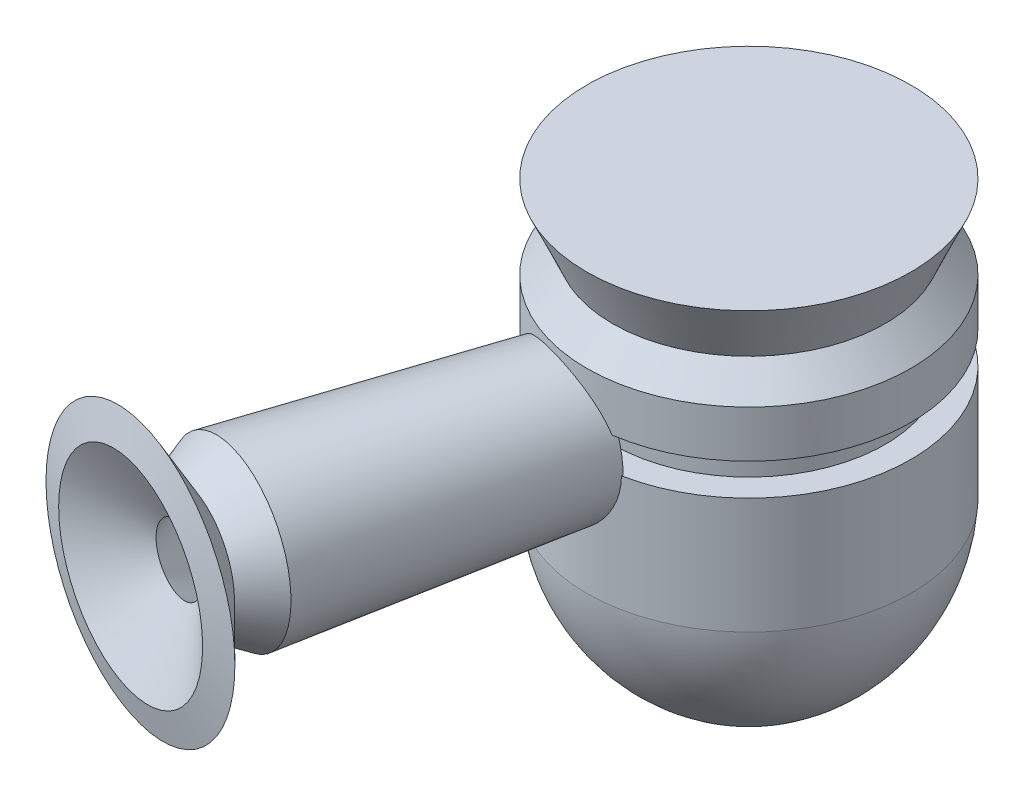
ISO-10303-21;
HEADER;
FILE_DESCRIPTION(('STEP AP214'),'2;1');
FILE_NAME('part.step','',(''),(''),'','','');
FILE_SCHEMA(('AUTOMOTIVE_DESIGN { 1 0 10303 214 1 1 1 1 }'));
ENDSEC;
DATA;
#1=APPLICATION_CONTEXT('core data for automotive mechanical design processes');
#2=APPLICATION_PROTOCOL_DEFINITION('international standard','automotive_design',2000,#1);
#3=PRODUCT_CONTEXT('',#1,'mechanical');
#4=PRODUCT('Part','Part','',(#3));
#5=PRODUCT_RELATED_PRODUCT_CATEGORY('part','',(#4));
#6=PRODUCT_DEFINITION_FORMATION('','',#4);
#7=PRODUCT_DEFINITION_CONTEXT('part definition',#1,'design');
#8=PRODUCT_DEFINITION('design','',#6,#7);
#9=PRODUCT_DEFINITION_SHAPE('','',#8);
#10=(LENGTH_UNIT() NAMED_UNIT(*) SI_UNIT(.MILLI.,.METRE.));
#11=(NAMED_UNIT(*) PLANE_ANGLE_UNIT() SI_UNIT($,.RADIAN.));
#12=(NAMED_UNIT(*) SI_UNIT($,.STERADIAN.) SOLID_ANGLE_UNIT());
#13=UNCERTAINTY_MEASURE_WITH_UNIT(LENGTH_MEASURE(1.E-05),#10,'distance_accuracy_value','');
#14=(GEOMETRIC_REPRESENTATION_CONTEXT(3) GLOBAL_UNCERTAINTY_ASSIGNED_CONTEXT((#13)) GLOBAL_UNIT_ASSIGNED_CONTEXT((#10,
#11,#12)) REPRESENTATION_CONTEXT('',''));
#15=CARTESIAN_POINT('',(0.,0.,0.));
#16=DIRECTION('',(0.,0.,1.));
#17=DIRECTION('',(1.,0.,0.));
#18=AXIS2_PLACEMENT_3D('',#15,#16,#17);
#19=CARTESIAN_POINT('',(-7.10834936745736,69.4079551613164,0.));
#20=DIRECTION('',(0.,1.,0.));
#21=DIRECTION('',(0.,0.,1.));
#22=AXIS2_PLACEMENT_3D('',#19,#20,#21);
#23=DEGENERATE_TOROIDAL_SURFACE('',#22,2.90756293698891,28.732983162707,.F.);
#24=CARTESIAN_POINT('',(-7.10834936745736,67.5094606230751,0.));
#25=DIRECTION('',(0.,1.,0.));
#26=DIRECTION('',(0.,0.,1.));
#27=AXIS2_PLACEMENT_3D('',#24,#25,#26);
#28=CIRCLE('',#27,25.7626313406345);
#29=CARTESIAN_POINT('',(-7.10834936745736,67.5094606230751,25.7626313406345));
#30=VERTEX_POINT('',#29);
#31=EDGE_CURVE('E114',#30,#30,#28,.T.);
#32=ORIENTED_EDGE('',*,*,#31,.F.);
#33=EDGE_LOOP('',(#32));
#34=FACE_BOUND('',#33,.T.);
#35=CARTESIAN_POINT('',(-7.10834936745736,44.8656856179775,0.));
#36=DIRECTION('',(0.,1.,0.));
#37=DIRECTION('',(0.,0.,1.));
#38=AXIS2_PLACEMENT_3D('',#35,#36,#37);
#39=CIRCLE('',#38,12.0343689023184);
#40=CARTESIAN_POINT('',(-7.10834936745736,44.8656856179775,12.0343689023184));
#41=VERTEX_POINT('',#40);
#42=EDGE_CURVE('E181',#41,#41,#39,.T.);
#43=ORIENTED_EDGE('',*,*,#42,.T.);
#44=EDGE_LOOP('',(#43));
#45=FACE_BOUND('',#44,.T.);
#46=ADVANCED_FACE('F39',(#34,#45),#23,.F.);
#47=CARTESIAN_POINT('',(-7.10834936745736,111.750471125418,0.));
#48=DIRECTION('',(0.,1.,0.));
#49=DIRECTION('',(0.,0.,1.));
#50=AXIS2_PLACEMENT_3D('',#47,#48,#49);
#51=CYLINDRICAL_SURFACE('',#50,25.7626313406345);
#52=CARTESIAN_POINT('',(-7.10834936745736,85.9516518030481,0.));
#53=DIRECTION('',(0.,1.,0.));
#54=DIRECTION('',(0.,0.,1.));
#55=AXIS2_PLACEMENT_3D('',#52,#53,#54);
#56=CIRCLE('',#55,25.7626313406345);
#57=CARTESIAN_POINT('',(-2.09294077422868,85.9516518030481,25.269722005523));
#58=VERTEX_POINT('',#57);
#59=CARTESIAN_POINT('',(-23.9964342906463,85.9516518030481,19.4552245224927));
#60=VERTEX_POINT('',#59);
#61=EDGE_CURVE('E108',#58,#60,#56,.T.);
#62=ORIENTED_EDGE('',*,*,#61,.F.);
#63=CARTESIAN_POINT('',(-2.09294077610805,85.9518518030481,25.269722005896));
#64=CARTESIAN_POINT('',(-2.09293656720588,85.7984719645325,25.2697190061388));
#65=CARTESIAN_POINT('',(-2.09625171683151,85.6451124607333,25.2703794127459));
#66=CARTESIAN_POINT('',(-2.10949883966492,85.3386968253718,25.2730040409252));
#67=CARTESIAN_POINT('',(-2.11943054359196,85.1856406817176,25.2749682094368));
#68=CARTESIAN_POINT('',(-2.1591011271364,84.7274980731125,25.2827786131677));
#69=CARTESIAN_POINT('',(-2.19871553421019,84.4232405162723,25.2905428025748));
#70=CARTESIAN_POINT('',(-2.30352003284658,83.8206857620337,25.3106617286325));
#71=CARTESIAN_POINT('',(-2.36860248504489,83.5223689610565,25.3229971337969));
#72=CARTESIAN_POINT('',(-2.52351461497049,82.9324038389565,25.3515020923657));
#73=CARTESIAN_POINT('',(-2.61334603920579,82.640755990028,25.3676719163495));
#74=CARTESIAN_POINT('',(-2.81655424163558,82.0664575600913,25.4028398730641));
#75=CARTESIAN_POINT('',(-2.92989541344612,81.7837941099825,25.4218337165326));
#76=CARTESIAN_POINT('',(-3.17901546214921,81.2286087754976,25.4615277132247));
#77=CARTESIAN_POINT('',(-3.31480285190694,80.9560907870784,25.482228512323));
#78=CARTESIAN_POINT('',(-3.7541219181697,80.1557403358051,25.5450591712052));
#79=CARTESIAN_POINT('',(-4.08959645001822,79.6451505658393,25.5879145916644));
#80=CARTESIAN_POINT('',(-4.85730388275295,78.6520977178606,25.6671567731319));
#81=CARTESIAN_POINT('',(-5.29411207676983,78.1731249279475,25.7030057414124));
#82=CARTESIAN_POINT('',(-6.00212431319835,77.5108349415528,25.7399610587167));
#83=CARTESIAN_POINT('',(-6.24709673261927,77.2993194227518,25.7494771489108));
#84=CARTESIAN_POINT('',(-6.75308821415843,76.8962921263743,25.7614225584039));
#85=CARTESIAN_POINT('',(-7.01410097680999,76.7047725746039,25.7638546418471));
#86=CARTESIAN_POINT('',(-7.56001705571709,76.3366135046553,25.7601692475637));
#87=CARTESIAN_POINT('',(-7.84544028875725,76.1607475720544,25.7537439769097));
#88=CARTESIAN_POINT('',(-8.42956332089683,75.8333818654893,25.7303902336893));
#89=CARTESIAN_POINT('',(-8.72826357925785,75.6818829352352,25.7134613975343));
#90=CARTESIAN_POINT('',(-9.33644751440155,75.4048061691808,25.6679116406755));
#91=CARTESIAN_POINT('',(-9.64592609701972,75.2792162771985,25.6392961766331));
#92=CARTESIAN_POINT('',(-10.2731973240358,75.0552548112737,25.5694437715472));
#93=CARTESIAN_POINT('',(-10.5909892426523,74.9568808699121,25.5282079289634));
#94=CARTESIAN_POINT('',(-11.2108675136647,74.7940967511485,25.4356864277996));
#95=CARTESIAN_POINT('',(-11.5126039951747,74.7278717765181,25.3852449408476));
#96=CARTESIAN_POINT('',(-12.1184104505612,74.6209354670245,25.2726602080328));
#97=CARTESIAN_POINT('',(-12.4224803248225,74.5802230490676,25.2105174590737));
#98=CARTESIAN_POINT('',(-13.0303013593332,74.5247964031969,25.0747003924042));
#99=CARTESIAN_POINT('',(-13.3340525946605,74.5100728861688,25.0010302051562));
#100=CARTESIAN_POINT('',(-13.9387930760471,74.5067574313359,24.8426225659441));
#101=CARTESIAN_POINT('',(-14.2397824336818,74.5181644331917,24.7578855631873));
#102=CARTESIAN_POINT('',(-14.8163737625817,74.5652875163419,24.584222561219));
#103=CARTESIAN_POINT('',(-15.0923177543474,74.5993103458273,24.4959656536494));
#104=CARTESIAN_POINT('',(-15.6377953389911,74.6895390848929,24.3114092050908));
#105=CARTESIAN_POINT('',(-15.9073292827304,74.7457437773464,24.2151101056082));
#106=CARTESIAN_POINT('',(-16.4383149656407,74.8797496110761,24.015523613745));
#107=CARTESIAN_POINT('',(-16.6997664913399,74.9575513222293,23.9122360370151));
#108=CARTESIAN_POINT('',(-17.21310815528,75.1339988605417,23.6998774303569));
#109=CARTESIAN_POINT('',(-17.464997962147,75.2326454093298,23.590806200302));
#110=CARTESIAN_POINT('',(-17.9629588816335,75.4521221295751,23.3659319131324));
#111=CARTESIAN_POINT('',(-18.2088074717179,75.5733626585506,23.2500370609032));
#112=CARTESIAN_POINT('',(-18.6881871041073,75.83568165621,23.0150348072124));
#113=CARTESIAN_POINT('',(-18.9217136965166,75.9767672250987,22.8959262683314));
#114=CARTESIAN_POINT('',(-19.3754639248792,76.2777263658809,22.6560575638176));
#115=CARTESIAN_POINT('',(-19.5956860046567,76.4376021291718,22.5352972069966));
#116=CARTESIAN_POINT('',(-20.0220543633753,76.7750963211925,22.2937087861105));
#117=CARTESIAN_POINT('',(-20.2281996893647,76.9527159491254,22.1728807180189));
#118=CARTESIAN_POINT('',(-20.6423395754946,77.3401664899157,21.9227636529709));
#119=CARTESIAN_POINT('',(-20.8490591087671,77.5514480104335,21.7936077880012));
#120=CARTESIAN_POINT('',(-21.2445536526636,77.992354194377,21.5391783990673));
#121=CARTESIAN_POINT('',(-21.4333278238243,78.2219797149899,21.4139050569076));
#122=CARTESIAN_POINT('',(-21.7924113710254,78.6984320640819,21.1692872375535));
#123=CARTESIAN_POINT('',(-21.9627107781069,78.9452680624721,21.0499459799361));
#124=CARTESIAN_POINT('',(-22.2841553645455,79.4547610075272,20.8193953074831));
#125=CARTESIAN_POINT('',(-22.4352980853653,79.7174199785173,20.7081869371819));
#126=CARTESIAN_POINT('',(-22.7244961829812,80.269932951842,20.491055824861));
#127=CARTESIAN_POINT('',(-22.8615945417053,80.5604856208535,20.3856318041267));
#128=CARTESIAN_POINT('',(-23.1133389118103,81.1555167794725,20.1885868813626));
#129=CARTESIAN_POINT('',(-23.2279944112062,81.4599893168238,20.0969601501428));
#130=CARTESIAN_POINT('',(-23.4340714859646,82.0805521388644,19.9299163710126));
#131=CARTESIAN_POINT('',(-23.5255244873988,82.396626038544,19.8544774195529));
#132=CARTESIAN_POINT('',(-23.6846780808781,83.0382663013493,19.7217957654183));
#133=CARTESIAN_POINT('',(-23.7523889469609,83.3638284923414,19.6645451930172));
#134=CARTESIAN_POINT('',(-23.8705181594839,84.0634464229282,19.5639909510259));
#135=CARTESIAN_POINT('',(-23.9176920276149,84.4384528419784,19.5233457736116));
#136=CARTESIAN_POINT('',(-23.9649115695213,85.0041926646897,19.482552543093));
#137=CARTESIAN_POINT('',(-23.9767278786373,85.1933360762144,19.4723172033995));
#138=CARTESIAN_POINT('',(-23.9924917370845,85.5722560863729,19.4586477029738));
#139=CARTESIAN_POINT('',(-23.996436767373,85.7620328682472,19.4552157195195));
#140=CARTESIAN_POINT('',(-23.9964342891857,85.9518518030481,19.4552245237605));
#141=B_SPLINE_CURVE_WITH_KNOTS('',3,(#63,#64,#65,#66,#67,#68,#69,#70,#71,#72,#73,#74,#75,#76,
#77,#78,#79,#80,#81,#82,#83,#84,#85,#86,#87,#88,#89,#90,#91,#92,#93,#94,#95,#96,#97,#98,#99,
#100,#101,#102,#103,#104,#105,#106,#107,#108,#109,#110,#111,#112,#113,#114,#115,#116,#117,#118,
#119,#120,#121,#122,#123,#124,#125,#126,#127,#128,#129,#130,#131,#132,#133,#134,#135,#136,#137,
#138,#139,#140),.UNSPECIFIED.,.F.,.F.,(4,2,2,2,2,2,2,2,2,2,2,2,2,2,2,2,2,2,2,2,2,2,2,2,2,2,2,2,
2,2,2,2,2,2,2,2,2,2,4),(0.,0.460061772684806,0.920104822904582,1.83960224754661,
2.75525472329127,3.67097183219267,4.58531204971273,5.49999983529855,7.32949908354318,
9.26804143543077,10.2385171656345,11.208614170298,12.2132851332336,13.2179908755268,
14.2222280410282,15.2263778240116,16.1641720455435,17.1019264518625,18.0393456122569,
18.9767267341852,19.8508195522371,20.7248644151719,21.5989323435782,22.4730305363614,
23.3649056855801,24.257100747496,25.1493999646751,26.0417595279431,27.0084155137945,
27.9751166964657,28.9423369421209,29.9096811937884,30.9227750566062,31.9354396911706,
32.9467253345908,33.9575728183246,35.0955116294597,35.6646308529003,36.2339321821698),.UNSPECIFIED.);
#142=EDGE_CURVE('E93',#58,#60,#141,.T.);
#143=ORIENTED_EDGE('',*,*,#142,.T.);
#144=EDGE_LOOP('',(#62,#143));
#145=FACE_BOUND('',#144,.T.);
#146=ORIENTED_EDGE('',*,*,#31,.T.);
#147=EDGE_LOOP('',(#146));
#148=FACE_BOUND('',#147,.T.);
#149=ADVANCED_FACE('F106',(#145,#148),#51,.T.);
#150=CARTESIAN_POINT('',(18.6542819731771,85.9516518030481,0.));
#151=DIRECTION('',(0.,-1.,0.));
#152=DIRECTION('',(0.,0.,-1.));
#153=AXIS2_PLACEMENT_3D('',#150,#151,#152);
#154=PLANE('',#153);
#155=CARTESIAN_POINT('',(-7.10834936745736,85.9516518030481,0.));
#156=DIRECTION('',(0.,1.,0.));
#157=DIRECTION('',(0.,0.,1.));
#158=AXIS2_PLACEMENT_3D('',#155,#156,#157);
#159=CIRCLE('',#158,21.6625311354834);
#160=CARTESIAN_POINT('',(-7.10834936745736,85.9516518030481,21.6625311354834));
#161=VERTEX_POINT('',#160);
#162=EDGE_CURVE('E115',#161,#161,#159,.T.);
#163=ORIENTED_EDGE('',*,*,#162,.F.);
#164=EDGE_LOOP('',(#163));
#165=FACE_BOUND('',#164,.T.);
#166=DIRECTION('',(0.961481196986305,0.,0.274870711138495));
#167=VECTOR('',#166,1.);
#168=CARTESIAN_POINT('',(-12.9415633990391,85.9516518030481,21.9389380676489));
#169=LINE('',#168,#167);
#170=CARTESIAN_POINT('',(-12.9415633990391,85.9516518030481,21.9389380676489));
#171=VERTEX_POINT('',#170);
#172=CARTESIAN_POINT('',(-2.04755275040952,85.9516518030481,25.0533457789229));
#173=VERTEX_POINT('',#172);
#174=EDGE_CURVE('E60',#171,#173,#169,.T.);
#175=ORIENTED_EDGE('',*,*,#174,.T.);
#176=DIRECTION('',(-0.20529636257545,0.,0.978699853639148));
#177=VECTOR('',#176,1.);
#178=CARTESIAN_POINT('',(52.0900141332175,85.9516518030481,-233.034172775687));
#179=LINE('',#178,#177);
#180=EDGE_CURVE('E110',#173,#58,#179,.T.);
#181=ORIENTED_EDGE('',*,*,#180,.T.);
#182=ORIENTED_EDGE('',*,*,#61,.T.);
#183=DIRECTION('',(0.975678364948973,0.,0.219207044071349));
#184=VECTOR('',#183,1.);
#185=CARTESIAN_POINT('',(-12.9415633990391,85.9516518030481,21.9389380676489));
#186=LINE('',#185,#184);
#187=EDGE_CURVE('E86',#60,#171,#186,.T.);
#188=ORIENTED_EDGE('',*,*,#187,.T.);
#189=EDGE_LOOP('',(#175,#181,#182,#188));
#190=FACE_BOUND('',#189,.T.);
#191=ADVANCED_FACE('F112',(#165,#190),#154,.F.);
#192=CARTESIAN_POINT('',(-7.10834936745736,111.750471125418,0.));
#193=DIRECTION('',(0.,1.,0.));
#194=DIRECTION('',(0.,0.,1.));
#195=AXIS2_PLACEMENT_3D('',#192,#193,#194);
#196=CYLINDRICAL_SURFACE('',#195,21.6625311354834);
#197=CARTESIAN_POINT('',(-7.10834936745736,91.0387429370366,0.));
#198=DIRECTION('',(0.,1.,0.));
#199=DIRECTION('',(0.,0.,1.));
#200=AXIS2_PLACEMENT_3D('',#197,#198,#199);
#201=CIRCLE('',#200,21.6625311354834);
#202=CARTESIAN_POINT('',(-7.10834936745736,91.0387429370366,21.6625311354834));
#203=VERTEX_POINT('',#202);
#204=EDGE_CURVE('E122',#203,#203,#201,.T.);
#205=ORIENTED_EDGE('',*,*,#204,.F.);
#206=EDGE_LOOP('',(#205));
#207=FACE_BOUND('',#206,.T.);
#208=ORIENTED_EDGE('',*,*,#162,.T.);
#209=EDGE_LOOP('',(#208));
#210=FACE_BOUND('',#209,.T.);
#211=ADVANCED_FACE('F163',(#207,#210),#196,.T.);
#212=CARTESIAN_POINT('',(14.554181768026,91.0387429370366,0.));
#213=DIRECTION('',(0.,1.,0.));
#214=DIRECTION('',(0.,0.,1.));
#215=AXIS2_PLACEMENT_3D('',#212,#213,#214);
#216=PLANE('',#215);
#217=CARTESIAN_POINT('',(-7.10834936745736,91.0387429370366,0.));
#218=DIRECTION('',(0.,1.,0.));
#219=DIRECTION('',(0.,0.,1.));
#220=AXIS2_PLACEMENT_3D('',#217,#218,#219);
#221=CIRCLE('',#220,25.7626313406345);
#222=CARTESIAN_POINT('',(-3.36701650641079,91.0387429370366,25.4895194544012));
#223=VERTEX_POINT('',#222);
#224=CARTESIAN_POINT('',(-22.9902396388921,91.0387429370366,20.2849386244955));
#225=VERTEX_POINT('',#224);
#226=EDGE_CURVE('E213',#223,#225,#221,.T.);
#227=ORIENTED_EDGE('',*,*,#226,.F.);
#228=CARTESIAN_POINT('',(-9.8769554664626,91.0387429370366,57.2249846654147));
#229=CARTESIAN_POINT('',(-9.05595094930689,91.0387429370366,53.2338685762515));
#230=CARTESIAN_POINT('',(-8.23565477818761,91.0387429370366,49.24260664151));
#231=CARTESIAN_POINT('',(-6.59676100523314,91.0387429370366,41.2597360248926));
#232=CARTESIAN_POINT('',(-5.77816340260163,91.0387429370366,37.2681273431801));
#233=CARTESIAN_POINT('',(-4.18782666368438,91.0387429370366,29.5036164298889));
#234=CARTESIAN_POINT('',(-3.41598184459158,91.0387429370366,25.7307358479373));
#235=CARTESIAN_POINT('',(-1.87437693254286,91.0387429370366,18.1845489166023));
#236=CARTESIAN_POINT('',(-1.1046168394996,91.0387429370366,14.4112425672367));
#237=CARTESIAN_POINT('',(0.432436478652625,91.0387429370366,6.86412386045209));
#238=CARTESIAN_POINT('',(1.1997297016049,91.0387429370366,3.09031150259364));
#239=CARTESIAN_POINT('',(2.73130938881674,91.0387429370366,-4.45792394190587));
#240=CARTESIAN_POINT('',(3.49559585252922,91.0387429370366,-8.23234702865792));
#241=CARTESIAN_POINT('',(4.25810918950469,91.0387429370366,-12.0071288022875));
#242=B_SPLINE_CURVE_WITH_KNOTS('',3,(#228,#229,#230,#231,#232,#233,#234,#235,#236,#237,#238,
#239,#240,#241),.UNSPECIFIED.,.F.,.F.,(4,2,2,2,2,2,4),(0.,12.2240544705132,24.4481032088688,
36.0011694243512,47.5542351558266,59.1073109849516,70.660388916059),.UNSPECIFIED.);
#243=CARTESIAN_POINT('',(-3.21686852129637,91.0387429370366,24.7551086473187));
#244=VERTEX_POINT('',#243);
#245=EDGE_CURVE('E68',#223,#244,#242,.T.);
#246=ORIENTED_EDGE('',*,*,#245,.T.);
#247=CARTESIAN_POINT('',(20.6041894149497,91.0387429370366,31.5401082758572));
#248=CARTESIAN_POINT('',(19.2060251717694,91.0387429370366,31.1408585583847));
#249=CARTESIAN_POINT('',(17.8078493728327,91.0387429370366,30.7416492929272));
#250=CARTESIAN_POINT('',(15.0114303592336,91.0387429370366,29.9433801804545));
#251=CARTESIAN_POINT('',(13.6131871438421,91.0387429370366,29.5443203359935));
#252=CARTESIAN_POINT('',(10.8160515812716,91.0387429370366,28.7462652664865));
#253=CARTESIAN_POINT('',(9.4171592065898,91.0387429370366,28.3472701378143));
#254=CARTESIAN_POINT('',(6.61928478532365,91.0387429370366,27.5496809707084));
#255=CARTESIAN_POINT('',(5.22030274057281,91.0387429370366,27.1510869258425));
#256=CARTESIAN_POINT('',(2.42312655826814,91.0387429370366,26.354887048256));
#257=CARTESIAN_POINT('',(1.02493256301489,91.0387429370366,25.957280716081));
#258=CARTESIAN_POINT('',(-1.07272730861461,91.0387429370366,25.3620373412416));
#259=CARTESIAN_POINT('',(-1.77202628762334,91.0387429370366,25.1638122802989));
#260=CARTESIAN_POINT('',(-3.17080331376586,91.0387429370366,24.7680001743798));
#261=CARTESIAN_POINT('',(-3.87028136050842,91.0387429370366,24.5704131280222));
#262=CARTESIAN_POINT('',(-5.26933303864536,91.0387429370366,24.1763679604304));
#263=CARTESIAN_POINT('',(-5.96890658118563,91.0387429370366,23.9799095237877));
#264=CARTESIAN_POINT('',(-7.36859747004313,91.0387429370366,23.5889035784879));
#265=CARTESIAN_POINT('',(-8.06871482202207,91.0387429370366,23.3943560900219));
#266=CARTESIAN_POINT('',(-9.11961661660344,91.0387429370366,23.1053178855964));
#267=CARTESIAN_POINT('',(-9.47001930243945,91.0387429370366,23.0094407394565));
#268=CARTESIAN_POINT('',(-10.1711740606715,91.0387429370366,22.8189707990595));
#269=CARTESIAN_POINT('',(-10.5219261330514,91.0387429370366,22.7243780047434));
#270=CARTESIAN_POINT('',(-11.2238712668706,91.0387429370366,22.5368763151678));
#271=CARTESIAN_POINT('',(-11.5750643169521,91.0387429370366,22.4439673774537));
#272=CARTESIAN_POINT('',(-12.2779840435742,91.0387429370366,22.2601911339159));
#273=CARTESIAN_POINT('',(-12.6297107190685,91.0387429370366,22.1693238240946));
#274=CARTESIAN_POINT('',(-13.3301282432284,91.0387429370366,21.9906977965624));
#275=CARTESIAN_POINT('',(-13.6788134128345,91.0387429370366,21.9029168096609));
#276=CARTESIAN_POINT('',(-14.37668287592,91.0387429370366,21.7293612320115));
#277=CARTESIAN_POINT('',(-14.7258671703341,91.0387429370366,21.6435866450257));
#278=CARTESIAN_POINT('',(-15.4246478946681,91.0387429370366,21.4736975006739));
#279=CARTESIAN_POINT('',(-15.7742443346198,91.0387429370366,21.3895829846365));
#280=CARTESIAN_POINT('',(-16.4737415733759,91.0387429370366,21.2226311261259));
#281=CARTESIAN_POINT('',(-16.8236423721958,91.0387429370366,21.1397937837178));
#282=CARTESIAN_POINT('',(-17.8737450454074,91.0387429370366,20.8926506082659));
#283=CARTESIAN_POINT('',(-18.5742728753758,91.0387429370366,20.7297315333486));
#284=CARTESIAN_POINT('',(-19.9757655439893,91.0387429370366,20.4058257546752));
#285=CARTESIAN_POINT('',(-20.6767303780543,91.0387429370366,20.2448390310135));
#286=CARTESIAN_POINT('',(-22.0791123086966,91.0387429370366,19.9239033236559));
#287=CARTESIAN_POINT('',(-22.7805294775323,91.0387429370366,19.7639546557934));
#288=CARTESIAN_POINT('',(-24.1835126209272,91.0387429370366,19.4447051708652));
#289=CARTESIAN_POINT('',(-24.8850785957959,91.0387429370366,19.2854043551613));
#290=CARTESIAN_POINT('',(-26.9898428822416,91.0387429370366,18.808116698647));
#291=CARTESIAN_POINT('',(-28.3931769794542,91.0387429370366,18.4907288224057));
#292=CARTESIAN_POINT('',(-31.2009906330508,91.0387429370366,17.8564517191391));
#293=CARTESIAN_POINT('',(-32.6054703033537,91.0387429370366,17.5395629969974));
#294=CARTESIAN_POINT('',(-35.4145431654099,91.0387429370366,16.9061837442979));
#295=CARTESIAN_POINT('',(-36.8191363586254,91.0387429370366,16.589693220224));
#296=CARTESIAN_POINT('',(-39.6277958792746,91.0387429370366,15.9570793594484));
#297=CARTESIAN_POINT('',(-41.0318621847164,91.0387429370366,15.6409559250804));
#298=CARTESIAN_POINT('',(-43.8400080400433,91.0387429370366,15.0088737570584));
#299=CARTESIAN_POINT('',(-45.2440875893481,91.0387429370366,14.6929150208265));
#300=CARTESIAN_POINT('',(-46.6481764560055,91.0387429370366,14.3769977161895));
#301=B_SPLINE_CURVE_WITH_KNOTS('',3,(#247,#248,#249,#250,#251,#252,#253,#254,#255,#256,#257,
#258,#259,#260,#261,#262,#263,#264,#265,#266,#267,#268,#269,#270,#271,#272,#273,#274,#275,#276,
#277,#278,#279,#280,#281,#282,#283,#284,#285,#286,#287,#288,#289,#290,#291,#292,#293,#294,#295,
#296,#297,#298,#299,#300),.UNSPECIFIED.,.F.,.F.,(4,2,2,2,2,2,2,2,2,2,2,2,2,2,2,2,2,2,2,2,2,2,2,
2,2,2,4),(0.,4.36215225869234,8.72437595589006,13.0884190886365,17.4523910825683,
21.8132774873307,23.9938300625051,26.1743779137355,28.354283428143,30.5342119506542,
31.6240589365364,32.7139058724029,33.8037252918494,34.8935425771991,35.9722303524637,
37.0509201502293,38.1296367689952,39.2083534428281,41.3660161304371,43.5236565724541,
45.6819253047172,47.8401985713981,52.1565314904502,56.4758872578729,60.7953124712432,
65.1129537122279,69.4305252100433),.UNSPECIFIED.);
#302=CARTESIAN_POINT('',(-22.8271185197594,91.0387429370366,19.7534616540969));
#303=VERTEX_POINT('',#302);
#304=EDGE_CURVE('E11',#244,#303,#301,.T.);
#305=ORIENTED_EDGE('',*,*,#304,.T.);
#306=CARTESIAN_POINT('',(-13.0471022382118,91.0387429370366,-12.0071288022875));
#307=CARTESIAN_POINT('',(-13.9814340210787,91.0387429370366,-8.98449079745986));
#308=CARTESIAN_POINT('',(-14.9146730621243,91.0387429370366,-5.9615152528273));
#309=CARTESIAN_POINT('',(-16.7792466661861,91.0387429370366,0.0850217525787136));
#310=CARTESIAN_POINT('',(-17.7105812300079,91.0387429370366,3.10858321310367));
#311=CARTESIAN_POINT('',(-19.9508591002223,91.0387429370366,10.3885488939943));
#312=CARTESIAN_POINT('',(-21.259006329346,91.0387429370366,14.6451980731376));
#313=CARTESIAN_POINT('',(-23.872661733017,91.0387429370366,23.1593068498632));
#314=CARTESIAN_POINT('',(-25.1781699073267,91.0387429370366,27.4167664475183));
#315=CARTESIAN_POINT('',(-27.7869953128809,91.0387429370366,35.9323625213971));
#316=CARTESIAN_POINT('',(-29.0903125414192,91.0387429370366,40.1904989984497));
#317=CARTESIAN_POINT('',(-31.6950845698149,91.0387429370366,48.7073406276749));
#318=CARTESIAN_POINT('',(-32.9965393700532,91.0387429370366,52.9660457797311));
#319=CARTESIAN_POINT('',(-34.2972282875342,91.0387429370366,57.2249846654147));
#320=B_SPLINE_CURVE_WITH_KNOTS('',3,(#306,#307,#308,#309,#310,#311,#312,#313,#314,#315,#316,
#317,#318,#319),.UNSPECIFIED.,.F.,.F.,(4,2,2,2,2,2,4),(0.,9.49125055559395,18.9824970946057,
32.3418673502278,45.7012388086663,59.0606267575542,72.4200119744325),.UNSPECIFIED.);
#321=EDGE_CURVE('E99',#303,#225,#320,.T.);
#322=ORIENTED_EDGE('',*,*,#321,.T.);
#323=EDGE_LOOP('',(#227,#246,#305,#322));
#324=FACE_BOUND('',#323,.T.);
#325=ORIENTED_EDGE('',*,*,#204,.T.);
#326=EDGE_LOOP('',(#325));
#327=FACE_BOUND('',#326,.T.);
#328=ADVANCED_FACE('F159',(#324,#327),#216,.F.);
#329=CARTESIAN_POINT('',(-7.10834936745736,111.750471125418,0.));
#330=DIRECTION('',(0.,1.,0.));
#331=DIRECTION('',(0.,0.,1.));
#332=AXIS2_PLACEMENT_3D('',#329,#330,#331);
#333=CYLINDRICAL_SURFACE('',#332,25.7626313406345);
#334=CARTESIAN_POINT('',(-7.10834936745736,98.4876978118055,0.));
#335=DIRECTION('',(0.,1.,0.));
#336=DIRECTION('',(0.,0.,1.));
#337=AXIS2_PLACEMENT_3D('',#334,#335,#336);
#338=CIRCLE('',#337,25.7626313406345);
#339=CARTESIAN_POINT('',(-7.10834936745736,98.4876978118055,25.7626313406345));
#340=VERTEX_POINT('',#339);
#341=EDGE_CURVE('E209',#340,#340,#338,.T.);
#342=ORIENTED_EDGE('',*,*,#341,.F.);
#343=EDGE_LOOP('',(#342));
#344=FACE_BOUND('',#343,.T.);
#345=ORIENTED_EDGE('',*,*,#226,.T.);
#346=CARTESIAN_POINT('',(-22.9903241136995,91.0385429370366,20.2848724855043));
#347=CARTESIAN_POINT('',(-22.8656882903289,91.3336568051999,20.3824477844196));
#348=CARTESIAN_POINT('',(-22.7300530046444,91.6218175578315,20.486799843855));
#349=CARTESIAN_POINT('',(-22.4374888192203,92.1825896580171,20.7066220391692));
#350=CARTESIAN_POINT('',(-22.2805648148147,92.4552045599244,20.8220896172706));
#351=CARTESIAN_POINT('',(-21.9458745672692,92.9836883642537,21.0618949191258));
#352=CARTESIAN_POINT('',(-21.7680841026859,93.2395372575088,21.1862428842388));
#353=CARTESIAN_POINT('',(-21.3924734982489,93.7326905517003,21.4412802472163));
#354=CARTESIAN_POINT('',(-21.1946537345618,93.9699953007625,21.5719695259618));
#355=CARTESIAN_POINT('',(-20.7796275433704,94.4246899911657,21.8373532715593));
#356=CARTESIAN_POINT('',(-20.5624167690595,94.6420754450338,21.9720486319036));
#357=CARTESIAN_POINT('',(-20.1095364820574,95.0553296950791,22.2430189682447));
#358=CARTESIAN_POINT('',(-19.8738762297634,95.2512091686941,22.379293122896));
#359=CARTESIAN_POINT('',(-19.3849973556036,95.6200566880859,22.6511651597856));
#360=CARTESIAN_POINT('',(-19.131783586199,95.7930310275405,22.7867632178999));
#361=CARTESIAN_POINT('',(-18.6088942149118,96.1146416815088,23.0550856024575));
#362=CARTESIAN_POINT('',(-18.3392190811778,96.2632786877155,23.1878100104799));
#363=CARTESIAN_POINT('',(-17.7901478383263,96.5321587945874,23.4457369487413));
#364=CARTESIAN_POINT('',(-17.5110359369712,96.6528901726137,23.571034746863));
#365=CARTESIAN_POINT('',(-16.9400430852762,96.8682333139491,23.8148550175159));
#366=CARTESIAN_POINT('',(-16.6481622140287,96.9628452390184,23.9333775320034));
#367=CARTESIAN_POINT('',(-16.0538043517169,97.1247755976816,24.1618152384256));
#368=CARTESIAN_POINT('',(-15.7513322450144,97.1921064369916,24.271734324268));
#369=CARTESIAN_POINT('',(-15.1380500727366,97.2986451793215,24.4814636890637));
#370=CARTESIAN_POINT('',(-14.8272407286171,97.3378555076344,24.5812748391521));
#371=CARTESIAN_POINT('',(-14.2269185170809,97.3854687440332,24.7614373287738));
#372=CARTESIAN_POINT('',(-13.9378707185579,97.396229458392,24.8427238528139));
#373=CARTESIAN_POINT('',(-13.3572163420319,97.3936576530975,24.9950976603612));
#374=CARTESIAN_POINT('',(-13.0656099279014,97.3803266654062,25.0661855920742));
#375=CARTESIAN_POINT('',(-12.4821380541763,97.3297103756945,25.1977181296394));
#376=CARTESIAN_POINT('',(-12.1902726496114,97.2924293168419,25.2581646183901));
#377=CARTESIAN_POINT('',(-11.6084785981757,97.194318263437,25.3682806845789));
#378=CARTESIAN_POINT('',(-11.3185499557869,97.1334882144075,25.4179502370856));
#379=CARTESIAN_POINT('',(-10.7517491380736,96.9911617157948,25.5052638795573));
#380=CARTESIAN_POINT('',(-10.4747508155032,96.910364291909,25.5432329933286));
#381=CARTESIAN_POINT('',(-9.92651080114175,96.7280113604853,25.6095174345377));
#382=CARTESIAN_POINT('',(-9.65526894972277,96.6264564293888,25.6378330299979));
#383=CARTESIAN_POINT('',(-9.12025422621545,96.4034449003121,25.6853567978066));
#384=CARTESIAN_POINT('',(-8.85648210111584,96.2819863201089,25.7045640623052));
#385=CARTESIAN_POINT('',(-8.33794335368749,96.0200724812814,25.7345828782818));
#386=CARTESIAN_POINT('',(-8.08318013082621,95.8796101461589,25.74539129209));
#387=CARTESIAN_POINT('',(-7.5696783803962,95.5719852298271,25.7598545627699));
#388=CARTESIAN_POINT('',(-7.31157317551316,95.4037437732142,25.7630559018957));
#389=CARTESIAN_POINT('',(-6.80870386561776,95.0482246031779,25.762116560282));
#390=CARTESIAN_POINT('',(-6.56394527897357,94.8609391060178,25.7579728659962));
#391=CARTESIAN_POINT('',(-6.08944724142355,94.4686144533045,25.7435685494969));
#392=CARTESIAN_POINT('',(-5.85970159337885,94.263582705452,25.7333104691456));
#393=CARTESIAN_POINT('',(-5.41651898826177,93.8368615111372,25.7079791980422));
#394=CARTESIAN_POINT('',(-5.20308553159504,93.6151685094945,25.6929049773777));
#395=CARTESIAN_POINT('',(-4.6802597994634,93.0287537175725,25.649939246503));
#396=CARTESIAN_POINT('',(-4.38331145755059,92.6529074095718,25.6195762182221));
#397=CARTESIAN_POINT('',(-3.97415040585956,92.0648598039355,25.5716418864595));
#398=CARTESIAN_POINT('',(-3.843850254433,91.864879412649,25.5552722538345));
#399=CARTESIAN_POINT('',(-3.59582202784964,91.4573013746095,25.5223608828575));
#400=CARTESIAN_POINT('',(-3.47809318091706,91.2497041965178,25.5058191551392));
#401=CARTESIAN_POINT('',(-3.36691120529173,91.0385429370366,25.4895039981584));
#402=B_SPLINE_CURVE_WITH_KNOTS('',3,(#346,#347,#348,#349,#350,#351,#352,#353,#354,#355,#356,
#357,#358,#359,#360,#361,#362,#363,#364,#365,#366,#367,#368,#369,#370,#371,#372,#373,#374,#375,
#376,#377,#378,#379,#380,#381,#382,#383,#384,#385,#386,#387,#388,#389,#390,#391,#392,#393,#394,
#395,#396,#397,#398,#399,#400,#401),.UNSPECIFIED.,.F.,.F.,(4,2,2,2,2,2,2,2,2,2,2,2,2,2,2,2,2,2,
2,2,2,2,2,2,2,2,2,4),(0.,1.00424877588445,2.00826701528442,3.01346244894519,4.0186390077156,
5.02404146149272,6.02894246703514,7.03356677893915,8.03816253339409,9.02356263523936,
10.0089566342776,10.9939020340478,11.9787624756023,12.8789917176976,13.7791637173285,
14.6791762799464,15.5791909246222,16.4513084445406,17.3234017488181,18.1955819585252,
19.0680878436987,19.9914326941795,20.9151564655344,21.8384964955545,22.7620341104562,
24.1978613454816,24.9152216200054,25.6325378290966),.UNSPECIFIED.);
#403=EDGE_CURVE('E53',#225,#223,#402,.T.);
#404=ORIENTED_EDGE('',*,*,#403,.T.);
#405=EDGE_LOOP('',(#345,#404));
#406=FACE_BOUND('',#405,.T.);
#407=ADVANCED_FACE('F132',(#344,#406),#333,.T.);
#408=CARTESIAN_POINT('',(-7.10834936745736,98.4876978118055,0.));
#409=DIRECTION('',(0.,-1.,0.));
#410=DIRECTION('',(0.,0.,-1.));
#411=AXIS2_PLACEMENT_3D('',#408,#409,#410);
#412=CONICAL_SURFACE('',#411,25.7626313406345,0.78539816339745);
#413=CARTESIAN_POINT('',(-7.10834936745736,102.587798016957,0.));
#414=DIRECTION('',(0.,1.,0.));
#415=DIRECTION('',(0.,0.,1.));
#416=AXIS2_PLACEMENT_3D('',#413,#414,#415);
#417=CIRCLE('',#416,21.6625311354834);
#418=CARTESIAN_POINT('',(-7.10834936745736,102.587798016957,21.6625311354834));
#419=VERTEX_POINT('',#418);
#420=EDGE_CURVE('E205',#419,#419,#417,.T.);
#421=ORIENTED_EDGE('',*,*,#420,.F.);
#422=EDGE_LOOP('',(#421));
#423=FACE_BOUND('',#422,.T.);
#424=ORIENTED_EDGE('',*,*,#341,.T.);
#425=EDGE_LOOP('',(#424));
#426=FACE_BOUND('',#425,.T.);
#427=ADVANCED_FACE('F254',(#423,#426),#412,.T.);
#428=CARTESIAN_POINT('',(-7.10834936745736,102.587798016957,0.));
#429=DIRECTION('',(0.,1.,0.));
#430=DIRECTION('',(0.,0.,1.));
#431=AXIS2_PLACEMENT_3D('',#428,#429,#430);
#432=CONICAL_SURFACE('',#431,21.6625311354834,0.420755156949889);
#433=CARTESIAN_POINT('',(-7.10834936745736,111.750471125418,0.));
#434=DIRECTION('',(0.,1.,0.));
#435=DIRECTION('',(0.,0.,1.));
#436=AXIS2_PLACEMENT_3D('',#433,#434,#435);
#437=CIRCLE('',#436,25.7626313406345);
#438=CARTESIAN_POINT('',(-7.10834936745736,111.750471125418,25.7626313406345));
#439=VERTEX_POINT('',#438);
#440=EDGE_CURVE('E201',#439,#439,#437,.T.);
#441=ORIENTED_EDGE('',*,*,#440,.F.);
#442=EDGE_LOOP('',(#441));
#443=FACE_BOUND('',#442,.T.);
#444=ORIENTED_EDGE('',*,*,#420,.T.);
#445=EDGE_LOOP('',(#444));
#446=FACE_BOUND('',#445,.T.);
#447=ADVANCED_FACE('F259',(#443,#446),#432,.T.);
#448=CARTESIAN_POINT('',(18.6542819731771,111.750471125418,0.));
#449=DIRECTION('',(0.,-1.,0.));
#450=DIRECTION('',(0.,0.,-1.));
#451=AXIS2_PLACEMENT_3D('',#448,#449,#450);
#452=PLANE('',#451);
#453=ORIENTED_EDGE('',*,*,#440,.T.);
#454=EDGE_LOOP('',(#453));
#455=FACE_BOUND('',#454,.T.);
#456=ADVANCED_FACE('F296',(#455),#452,.F.);
#457=CARTESIAN_POINT('',(-7.10834936745736,98.4876978118055,0.));
#458=DIRECTION('',(0.,1.,0.));
#459=DIRECTION('',(0.,0.,1.));
#460=AXIS2_PLACEMENT_3D('',#457,#458,#459);
#461=PLANE('',#460);
#462=CARTESIAN_POINT('',(-7.10834936745736,98.4876978118055,0.));
#463=DIRECTION('',(0.,1.,0.));
#464=DIRECTION('',(0.,0.,1.));
#465=AXIS2_PLACEMENT_3D('',#462,#463,#464);
#466=CIRCLE('',#465,15.1048815331985);
#467=CARTESIAN_POINT('',(-7.10834936745736,98.4876978118055,15.1048815331985));
#468=VERTEX_POINT('',#467);
#469=EDGE_CURVE('E197',#468,#468,#466,.T.);
#470=ORIENTED_EDGE('',*,*,#469,.F.);
#471=EDGE_LOOP('',(#470));
#472=FACE_BOUND('',#471,.T.);
#473=ADVANCED_FACE('F291',(#472),#461,.F.);
#474=CARTESIAN_POINT('',(-7.10834936745736,111.750471125418,0.));
#475=DIRECTION('',(0.,1.,0.));
#476=DIRECTION('',(0.,0.,1.));
#477=AXIS2_PLACEMENT_3D('',#474,#475,#476);
#478=CYLINDRICAL_SURFACE('',#477,15.1048815331985);
#479=CARTESIAN_POINT('',(-7.10834936745736,57.4276050874696,0.));
#480=DIRECTION('',(0.,1.,0.));
#481=DIRECTION('',(0.,0.,1.));
#482=AXIS2_PLACEMENT_3D('',#479,#480,#481);
#483=CIRCLE('',#482,15.1048815331985);
#484=CARTESIAN_POINT('',(-7.10834936745736,57.4276050874696,15.1048815331985));
#485=VERTEX_POINT('',#484);
#486=EDGE_CURVE('E193',#485,#485,#483,.T.);
#487=ORIENTED_EDGE('',*,*,#486,.F.);
#488=EDGE_LOOP('',(#487));
#489=FACE_BOUND('',#488,.T.);
#490=ORIENTED_EDGE('',*,*,#469,.T.);
#491=EDGE_LOOP('',(#490));
#492=FACE_BOUND('',#491,.T.);
#493=ADVANCED_FACE('F285',(#489,#492),#478,.F.);
#494=CARTESIAN_POINT('',(7.99653216574117,57.4276050874696,0.));
#495=DIRECTION('',(0.,-1.,0.));
#496=DIRECTION('',(0.,0.,-1.));
#497=AXIS2_PLACEMENT_3D('',#494,#495,#496);
#498=PLANE('',#497);
#499=CARTESIAN_POINT('',(-7.10834936745736,57.4276050874696,0.));
#500=DIRECTION('',(0.,1.,0.));
#501=DIRECTION('',(0.,0.,1.));
#502=AXIS2_PLACEMENT_3D('',#499,#500,#501);
#503=CIRCLE('',#502,7.55244076659926);
#504=CARTESIAN_POINT('',(-7.10834936745736,57.4276050874696,7.55244076659926));
#505=VERTEX_POINT('',#504);
#506=EDGE_CURVE('E189',#505,#505,#503,.T.);
#507=ORIENTED_EDGE('',*,*,#506,.F.);
#508=EDGE_LOOP('',(#507));
#509=FACE_BOUND('',#508,.T.);
#510=ORIENTED_EDGE('',*,*,#486,.T.);
#511=EDGE_LOOP('',(#510));
#512=FACE_BOUND('',#511,.T.);
#513=ADVANCED_FACE('F279',(#509,#512),#498,.F.);
#514=CARTESIAN_POINT('',(-7.10834936745736,111.750471125418,0.));
#515=DIRECTION('',(0.,1.,0.));
#516=DIRECTION('',(0.,0.,1.));
#517=AXIS2_PLACEMENT_3D('',#514,#515,#516);
#518=CYLINDRICAL_SURFACE('',#517,7.55244076659926);
#519=CARTESIAN_POINT('',(-7.10834936745736,44.8656856179775,0.));
#520=DIRECTION('',(0.,1.,0.));
#521=DIRECTION('',(0.,0.,1.));
#522=AXIS2_PLACEMENT_3D('',#519,#520,#521);
#523=CIRCLE('',#522,7.55244076659926);
#524=CARTESIAN_POINT('',(-7.10834936745736,44.8656856179775,7.55244076659926));
#525=VERTEX_POINT('',#524);
#526=EDGE_CURVE('E185',#525,#525,#523,.T.);
#527=ORIENTED_EDGE('',*,*,#526,.F.);
#528=EDGE_LOOP('',(#527));
#529=FACE_BOUND('',#528,.T.);
#530=ORIENTED_EDGE('',*,*,#506,.T.);
#531=EDGE_LOOP('',(#530));
#532=FACE_BOUND('',#531,.T.);
#533=ADVANCED_FACE('F273',(#529,#532),#518,.F.);
#534=CARTESIAN_POINT('',(0.444091399141909,44.8656856179775,0.));
#535=DIRECTION('',(0.,1.,0.));
#536=DIRECTION('',(0.,0.,1.));
#537=AXIS2_PLACEMENT_3D('',#534,#535,#536);
#538=PLANE('',#537);
#539=ORIENTED_EDGE('',*,*,#42,.F.);
#540=EDGE_LOOP('',(#539));
#541=FACE_BOUND('',#540,.T.);
#542=ORIENTED_EDGE('',*,*,#526,.T.);
#543=EDGE_LOOP('',(#542));
#544=FACE_BOUND('',#543,.T.);
#545=ADVANCED_FACE('F270',(#541,#544),#538,.F.);
#546=CARTESIAN_POINT('',(-12.9415633990391,85.9516518030481,21.9389380676489));
#547=DIRECTION('',(-0.247140844343544,0.,0.968979567925537));
#548=DIRECTION('',(0.968979567925537,0.,0.247140844343544));
#549=AXIS2_PLACEMENT_3D('',#546,#547,#548);
#550=CONICAL_SURFACE('',#549,0.,1.54206954786429);
#551=ORIENTED_EDGE('',*,*,#174,.F.);
#552=ORIENTED_EDGE('',*,*,#187,.F.);
#553=CARTESIAN_POINT('',(-13.0219935205279,85.9516518030481,22.2542851507078));
#554=DIRECTION('',(0.247140844343544,0.,-0.968979567925537));
#555=DIRECTION('',(-0.968979567925537,0.,-0.247140844343544));
#556=AXIS2_PLACEMENT_3D('',#553,#554,#555);
#557=CIRCLE('',#556,11.3257710826796);
#558=EDGE_CURVE('E89',#60,#303,#557,.T.);
#559=ORIENTED_EDGE('',*,*,#558,.T.);
#560=ORIENTED_EDGE('',*,*,#304,.F.);
#561=EDGE_CURVE('E102',#244,#173,#557,.T.);
#562=ORIENTED_EDGE('',*,*,#561,.T.);
#563=EDGE_LOOP('',(#551,#552,#559,#560,#562));
#564=FACE_BOUND('',#563,.T.);
#565=ADVANCED_FACE('F88',(#564),#550,.T.);
#566=CARTESIAN_POINT('',(-13.0219935205279,85.9516518030481,22.2542851507078));
#567=DIRECTION('',(-0.247140844343544,0.,0.968979567925537));
#568=DIRECTION('',(0.968979567925537,0.,0.247140844343544));
#569=AXIS2_PLACEMENT_3D('',#566,#567,#568);
#570=CONICAL_SURFACE('',#569,11.3257710826796,0.0429619422760652);
#571=CARTESIAN_POINT('',(-24.0344455424639,85.9516518030481,65.431450100355));
#572=DIRECTION('',(0.247140844343544,0.,-0.968979567925537));
#573=DIRECTION('',(-0.968979567925537,0.,-0.247140844343544));
#574=AXIS2_PLACEMENT_3D('',#571,#572,#573);
#575=CIRCLE('',#574,13.2413088637092);
#576=CARTESIAN_POINT('',(-36.8650032839895,85.9516518030481,62.1589818475643));
#577=VERTEX_POINT('',#576);
#578=EDGE_CURVE('E101',#577,#577,#575,.T.);
#579=ORIENTED_EDGE('',*,*,#578,.T.);
#580=EDGE_LOOP('',(#579));
#581=FACE_BOUND('',#580,.T.);
#582=ORIENTED_EDGE('',*,*,#142,.F.);
#583=ORIENTED_EDGE('',*,*,#180,.F.);
#584=ORIENTED_EDGE('',*,*,#561,.F.);
#585=ORIENTED_EDGE('',*,*,#245,.F.);
#586=ORIENTED_EDGE('',*,*,#403,.F.);
#587=ORIENTED_EDGE('',*,*,#321,.F.);
#588=ORIENTED_EDGE('',*,*,#558,.F.);
#589=EDGE_LOOP('',(#582,#583,#584,#585,#586,#587,#588));
#590=FACE_BOUND('',#589,.T.);
#591=ADVANCED_FACE('F96',(#581,#590),#570,.T.);
#592=CARTESIAN_POINT('',(-17.1413143420767,85.9516518030481,38.4051473054979));
#593=DIRECTION('',(-0.247140844343544,0.,0.968979567925537));
#594=DIRECTION('',(0.968979567925537,0.,0.247140844343544));
#595=AXIS2_PLACEMENT_3D('',#592,#593,#594);
#596=PLANE('',#595);
#597=CARTESIAN_POINT('',(-17.1413143420767,85.9516518030481,38.4051473054979));
#598=DIRECTION('',(0.247140844343544,0.,-0.968979567925537));
#599=DIRECTION('',(-0.968979567925537,0.,-0.247140844343544));
#600=AXIS2_PLACEMENT_3D('',#597,#598,#599);
#601=CIRCLE('',#600,3.42573513860956);
#602=CARTESIAN_POINT('',(-20.4607816965139,85.9516518030481,37.5585082308446));
#603=VERTEX_POINT('',#602);
#604=EDGE_CURVE('E225',#603,#603,#601,.T.);
#605=ORIENTED_EDGE('',*,*,#604,.F.);
#606=EDGE_LOOP('',(#605));
#607=FACE_BOUND('',#606,.T.);
#608=ADVANCED_FACE('F138',(#607),#596,.T.);
#609=CARTESIAN_POINT('',(-24.0344455424639,85.9516518030481,65.431450100355));
#610=DIRECTION('',(-0.247140844343544,0.,0.968979567925537));
#611=DIRECTION('',(0.968979567925537,0.,0.247140844343544));
#612=AXIS2_PLACEMENT_3D('',#609,#610,#611);
#613=CONICAL_SURFACE('',#612,9.04845945928861,0.19892651893541);
#614=ORIENTED_EDGE('',*,*,#604,.T.);
#615=EDGE_LOOP('',(#614));
#616=FACE_BOUND('',#615,.T.);
#617=CARTESIAN_POINT('',(-24.0344455424639,85.9516518030481,65.431450100355));
#618=DIRECTION('',(0.247140844343544,0.,-0.968979567925537));
#619=DIRECTION('',(-0.968979567925537,0.,-0.247140844343544));
#620=AXIS2_PLACEMENT_3D('',#617,#618,#619);
#621=CIRCLE('',#620,9.04845945928861);
#622=CARTESIAN_POINT('',(-32.8022178797172,85.9516518030481,63.1952061895781));
#623=VERTEX_POINT('',#622);
#624=EDGE_CURVE('E228',#623,#623,#621,.T.);
#625=ORIENTED_EDGE('',*,*,#624,.F.);
#626=EDGE_LOOP('',(#625));
#627=FACE_BOUND('',#626,.T.);
#628=ADVANCED_FACE('F393',(#616,#627),#613,.F.);
#629=CARTESIAN_POINT('',(-25.7050572573413,85.9516518030481,71.9815151936139));
#630=DIRECTION('',(0.247140844343544,0.,-0.968979567925537));
#631=DIRECTION('',(-0.968979567925537,0.,-0.247140844343544));
#632=AXIS2_PLACEMENT_3D('',#629,#630,#631);
#633=CONICAL_SURFACE('',#632,5.07169368385006,0.531772306695644);
#634=ORIENTED_EDGE('',*,*,#624,.T.);
#635=EDGE_LOOP('',(#634));
#636=FACE_BOUND('',#635,.T.);
#637=CARTESIAN_POINT('',(-25.7050572573413,85.9516518030481,71.9815151936139));
#638=DIRECTION('',(0.247140844343544,0.,-0.968979567925537));
#639=DIRECTION('',(-0.968979567925537,0.,-0.247140844343544));
#640=AXIS2_PLACEMENT_3D('',#637,#638,#639);
#641=CIRCLE('',#640,5.07169368385006);
#642=CARTESIAN_POINT('',(-30.619424811769,85.9516518030481,70.7280925343354));
#643=VERTEX_POINT('',#642);
#644=EDGE_CURVE('E231',#643,#643,#641,.T.);
#645=ORIENTED_EDGE('',*,*,#644,.F.);
#646=EDGE_LOOP('',(#645));
#647=FACE_BOUND('',#646,.T.);
#648=ADVANCED_FACE('F403',(#636,#647),#633,.F.);
#649=CARTESIAN_POINT('',(-27.2722324224034,85.9516518030481,78.1260305542339));
#650=DIRECTION('',(-0.247140844343544,0.,0.968979567925537));
#651=DIRECTION('',(0.968979567925537,0.,0.247140844343544));
#652=AXIS2_PLACEMENT_3D('',#649,#650,#651);
#653=CONICAL_SURFACE('',#652,15.8505826577375,1.03902402009925);
#654=ORIENTED_EDGE('',*,*,#644,.T.);
#655=EDGE_LOOP('',(#654));
#656=FACE_BOUND('',#655,.T.);
#657=CARTESIAN_POINT('',(-27.2722324224034,85.9516518030481,78.1260305542339));
#658=DIRECTION('',(0.247140844343544,0.,-0.968979567925537));
#659=DIRECTION('',(-0.968979567925537,0.,-0.247140844343544));
#660=AXIS2_PLACEMENT_3D('',#657,#658,#659);
#661=CIRCLE('',#660,15.8505826577375);
#662=CARTESIAN_POINT('',(-42.6311231574659,85.9516518030481,74.2087041728635));
#663=VERTEX_POINT('',#662);
#664=EDGE_CURVE('E235',#663,#663,#661,.T.);
#665=ORIENTED_EDGE('',*,*,#664,.F.);
#666=EDGE_LOOP('',(#665));
#667=FACE_BOUND('',#666,.T.);
#668=ADVANCED_FACE('F413',(#656,#667),#653,.F.);
#669=CARTESIAN_POINT('',(-26.9551136421202,85.9516518030481,76.8826843986599));
#670=DIRECTION('',(0.247140844343544,0.,-0.968979567925537));
#671=DIRECTION('',(-0.968979567925537,0.,-0.247140844343544));
#672=AXIS2_PLACEMENT_3D('',#669,#670,#671);
#673=CONICAL_SURFACE('',#672,20.8008585848488,1.31717047009311);
#674=ORIENTED_EDGE('',*,*,#664,.T.);
#675=EDGE_LOOP('',(#674));
#676=FACE_BOUND('',#675,.T.);
#677=CARTESIAN_POINT('',(-26.9551136421202,85.9516518030481,76.8826843986599));
#678=DIRECTION('',(0.247140844343544,0.,-0.968979567925537));
#679=DIRECTION('',(-0.968979567925537,0.,-0.247140844343544));
#680=AXIS2_PLACEMENT_3D('',#677,#678,#679);
#681=CIRCLE('',#680,20.8008585848488);
#682=CARTESIAN_POINT('',(-47.1107206061472,85.9516518030481,71.7419426449298));
#683=VERTEX_POINT('',#682);
#684=EDGE_CURVE('E239',#683,#683,#681,.T.);
#685=ORIENTED_EDGE('',*,*,#684,.F.);
#686=EDGE_LOOP('',(#685));
#687=FACE_BOUND('',#686,.T.);
#688=ADVANCED_FACE('F423',(#676,#687),#673,.T.);
#689=CARTESIAN_POINT('',(-25.3876631497667,85.9516518030481,70.73708954622));
#690=DIRECTION('',(-0.247140844343544,0.,0.968979567925537));
#691=DIRECTION('',(0.968979567925537,0.,0.247140844343544));
#692=AXIS2_PLACEMENT_3D('',#689,#690,#691);
#693=CONICAL_SURFACE('',#692,10.0200759347651,1.03902402009925);
#694=ORIENTED_EDGE('',*,*,#684,.T.);
#695=EDGE_LOOP('',(#694));
#696=FACE_BOUND('',#695,.T.);
#697=CARTESIAN_POINT('',(-25.3876631497667,85.9516518030481,70.73708954622));
#698=DIRECTION('',(0.247140844343544,0.,-0.968979567925537));
#699=DIRECTION('',(-0.968979567925537,0.,-0.247140844343544));
#700=AXIS2_PLACEMENT_3D('',#697,#698,#699);
#701=CIRCLE('',#700,10.0200759347651);
#702=CARTESIAN_POINT('',(-35.0969119996165,85.9516518030481,68.2607195193157));
#703=VERTEX_POINT('',#702);
#704=EDGE_CURVE('E243',#703,#703,#701,.T.);
#705=ORIENTED_EDGE('',*,*,#704,.F.);
#706=EDGE_LOOP('',(#705));
#707=FACE_BOUND('',#706,.T.);
#708=ADVANCED_FACE('F433',(#696,#707),#693,.T.);
#709=CARTESIAN_POINT('',(-24.0344455424639,85.9516518030481,65.431450100355));
#710=DIRECTION('',(0.247140844343544,0.,-0.968979567925537));
#711=DIRECTION('',(-0.968979567925537,0.,-0.247140844343544));
#712=AXIS2_PLACEMENT_3D('',#709,#710,#711);
#713=CONICAL_SURFACE('',#712,13.2413088637092,0.531772306695645);
#714=ORIENTED_EDGE('',*,*,#704,.T.);
#715=EDGE_LOOP('',(#714));
#716=FACE_BOUND('',#715,.T.);
#717=ORIENTED_EDGE('',*,*,#578,.F.);
#718=EDGE_LOOP('',(#717));
#719=FACE_BOUND('',#718,.T.);
#720=ADVANCED_FACE('F141',(#716,#719),#713,.T.);
#721=CLOSED_SHELL('',(#46,#149,#191,#211,#328,#407,#427,#447,#456,#473,#493,#513,#533,#545,#565,
#591,#608,#628,#648,#668,#688,#708,#720));
#722=MANIFOLD_SOLID_BREP('B2',#721);
#723=ADVANCED_BREP_SHAPE_REPRESENTATION('',(#18,#722),#14);
#724=SHAPE_DEFINITION_REPRESENTATION(#9,#723);
ENDSEC;
END-ISO-10303-21;
